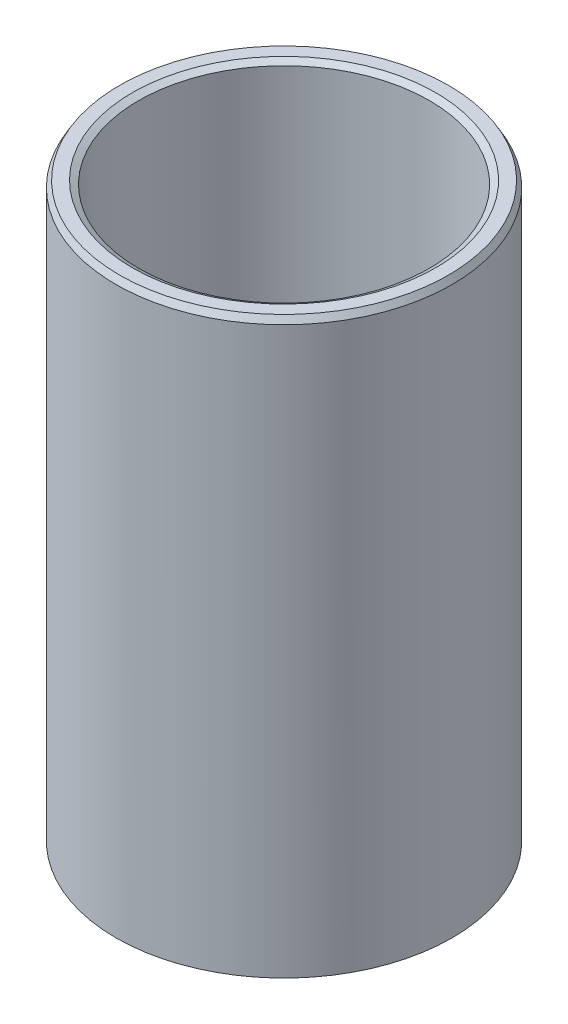
ISO-10303-21;
HEADER;
FILE_DESCRIPTION(('STEP AP214'),'2;1');
FILE_NAME('part.step','',(''),(''),'','','');
FILE_SCHEMA(('AUTOMOTIVE_DESIGN { 1 0 10303 214 1 1 1 1 }'));
ENDSEC;
DATA;
#1=APPLICATION_CONTEXT('core data for automotive mechanical design processes');
#2=APPLICATION_PROTOCOL_DEFINITION('international standard','automotive_design',2000,#1);
#3=PRODUCT_CONTEXT('',#1,'mechanical');
#4=PRODUCT('Part','Part','',(#3));
#5=PRODUCT_RELATED_PRODUCT_CATEGORY('part','',(#4));
#6=PRODUCT_DEFINITION_FORMATION('','',#4);
#7=PRODUCT_DEFINITION_CONTEXT('part definition',#1,'design');
#8=PRODUCT_DEFINITION('design','',#6,#7);
#9=PRODUCT_DEFINITION_SHAPE('','',#8);
#10=(LENGTH_UNIT() NAMED_UNIT(*) SI_UNIT(.MILLI.,.METRE.));
#11=(NAMED_UNIT(*) PLANE_ANGLE_UNIT() SI_UNIT($,.RADIAN.));
#12=(NAMED_UNIT(*) SI_UNIT($,.STERADIAN.) SOLID_ANGLE_UNIT());
#13=UNCERTAINTY_MEASURE_WITH_UNIT(LENGTH_MEASURE(1.E-05),#10,'distance_accuracy_value','');
#14=(GEOMETRIC_REPRESENTATION_CONTEXT(3) GLOBAL_UNCERTAINTY_ASSIGNED_CONTEXT((#13)) GLOBAL_UNIT_ASSIGNED_CONTEXT((#10,
#11,#12)) REPRESENTATION_CONTEXT('',''));
#15=CARTESIAN_POINT('',(0.,0.,0.));
#16=DIRECTION('',(0.,0.,1.));
#17=DIRECTION('',(1.,0.,0.));
#18=AXIS2_PLACEMENT_3D('',#15,#16,#17);
#19=CARTESIAN_POINT('',(0.,154.16567837042,0.));
#20=DIRECTION('',(0.,-1.,0.));
#21=DIRECTION('',(0.,0.,-1.));
#22=AXIS2_PLACEMENT_3D('',#19,#20,#21);
#23=CYLINDRICAL_SURFACE('',#22,45.);
#24=CARTESIAN_POINT('',(0.,0.978528132619838,0.));
#25=DIRECTION('',(0.,1.,0.));
#26=DIRECTION('',(0.,0.,1.));
#27=AXIS2_PLACEMENT_3D('',#24,#25,#26);
#28=CIRCLE('',#27,45.);
#29=CARTESIAN_POINT('',(0.,0.978528132619838,45.));
#30=VERTEX_POINT('',#29);
#31=EDGE_CURVE('E10',#30,#30,#28,.T.);
#32=ORIENTED_EDGE('',*,*,#31,.T.);
#33=EDGE_LOOP('',(#32));
#34=FACE_BOUND('',#33,.T.);
#35=CARTESIAN_POINT('',(0.,152.470817928087,0.));
#36=DIRECTION('',(0.,1.,0.));
#37=DIRECTION('',(0.,0.,1.));
#38=AXIS2_PLACEMENT_3D('',#35,#36,#37);
#39=CIRCLE('',#38,45.);
#40=CARTESIAN_POINT('',(0.,152.470817928087,-45.));
#41=VERTEX_POINT('',#40);
#42=EDGE_CURVE('E50',#41,#41,#39,.F.);
#43=ORIENTED_EDGE('',*,*,#42,.T.);
#44=EDGE_LOOP('',(#43));
#45=FACE_BOUND('',#44,.T.);
#46=ADVANCED_FACE('F39',(#34,#45),#23,.T.);
#47=CARTESIAN_POINT('',(0.,154.16567837042,0.));
#48=DIRECTION('',(0.,1.,0.));
#49=DIRECTION('',(0.,0.,1.));
#50=AXIS2_PLACEMENT_3D('',#47,#48,#49);
#51=PLANE('',#50);
#52=CARTESIAN_POINT('',(0.,154.16567837042,0.));
#53=DIRECTION('',(0.,1.,0.));
#54=DIRECTION('',(0.,0.,1.));
#55=AXIS2_PLACEMENT_3D('',#52,#53,#54);
#56=CIRCLE('',#55,40.6179186015309);
#57=CARTESIAN_POINT('',(0.,154.16567837042,40.6179186015309));
#58=VERTEX_POINT('',#57);
#59=EDGE_CURVE('E58',#58,#58,#56,.F.);
#60=ORIENTED_EDGE('',*,*,#59,.T.);
#61=EDGE_LOOP('',(#60));
#62=FACE_BOUND('',#61,.T.);
#63=CARTESIAN_POINT('',(0.,154.16567837042,0.));
#64=DIRECTION('',(0.,1.,0.));
#65=DIRECTION('',(0.,0.,1.));
#66=AXIS2_PLACEMENT_3D('',#63,#64,#65);
#67=CIRCLE('',#66,44.0214718673801);
#68=CARTESIAN_POINT('',(0.,154.16567837042,-44.0214718673801));
#69=VERTEX_POINT('',#68);
#70=EDGE_CURVE('E61',#69,#69,#67,.T.);
#71=ORIENTED_EDGE('',*,*,#70,.T.);
#72=EDGE_LOOP('',(#71));
#73=FACE_BOUND('',#72,.T.);
#74=ADVANCED_FACE('F88',(#62,#73),#51,.T.);
#75=CARTESIAN_POINT('',(0.,0.,0.));
#76=DIRECTION('',(0.,1.,0.));
#77=DIRECTION('',(0.,0.,1.));
#78=AXIS2_PLACEMENT_3D('',#75,#76,#77);
#79=PLANE('',#78);
#80=CARTESIAN_POINT('',(0.,0.,0.));
#81=DIRECTION('',(0.,1.,0.));
#82=DIRECTION('',(0.,0.,1.));
#83=AXIS2_PLACEMENT_3D('',#80,#81,#82);
#84=CIRCLE('',#83,39.9015862918177);
#85=CARTESIAN_POINT('',(0.,0.,-39.9015862918177));
#86=VERTEX_POINT('',#85);
#87=EDGE_CURVE('E51',#86,#86,#84,.T.);
#88=ORIENTED_EDGE('',*,*,#87,.T.);
#89=EDGE_LOOP('',(#88));
#90=FACE_BOUND('',#89,.T.);
#91=CARTESIAN_POINT('',(0.,0.,0.));
#92=DIRECTION('',(0.,1.,0.));
#93=DIRECTION('',(0.,0.,1.));
#94=AXIS2_PLACEMENT_3D('',#91,#92,#93);
#95=CIRCLE('',#94,43.3051395576669);
#96=CARTESIAN_POINT('',(0.,0.,43.3051395576669));
#97=VERTEX_POINT('',#96);
#98=EDGE_CURVE('E54',#97,#97,#95,.F.);
#99=ORIENTED_EDGE('',*,*,#98,.T.);
#100=EDGE_LOOP('',(#99));
#101=FACE_BOUND('',#100,.T.);
#102=ADVANCED_FACE('F83',(#90,#101),#79,.F.);
#103=CARTESIAN_POINT('',(0.,154.16567837042,0.));
#104=DIRECTION('',(0.,-1.,0.));
#105=DIRECTION('',(0.,0.,-1.));
#106=AXIS2_PLACEMENT_3D('',#103,#104,#105);
#107=CYLINDRICAL_SURFACE('',#106,38.9230581591978);
#108=CARTESIAN_POINT('',(0.,153.1871502378,0.));
#109=DIRECTION('',(0.,1.,0.));
#110=DIRECTION('',(0.,0.,1.));
#111=AXIS2_PLACEMENT_3D('',#108,#109,#110);
#112=CIRCLE('',#111,38.9230581591978);
#113=CARTESIAN_POINT('',(0.,153.1871502378,38.9230581591978));
#114=VERTEX_POINT('',#113);
#115=EDGE_CURVE('E67',#114,#114,#112,.T.);
#116=ORIENTED_EDGE('',*,*,#115,.T.);
#117=EDGE_LOOP('',(#116));
#118=FACE_BOUND('',#117,.T.);
#119=CARTESIAN_POINT('',(0.,1.69486044233311,0.));
#120=DIRECTION('',(0.,1.,0.));
#121=DIRECTION('',(0.,0.,1.));
#122=AXIS2_PLACEMENT_3D('',#119,#120,#121);
#123=CIRCLE('',#122,38.9230581591978);
#124=CARTESIAN_POINT('',(0.,1.69486044233311,-38.9230581591978));
#125=VERTEX_POINT('',#124);
#126=EDGE_CURVE('E69',#125,#125,#123,.F.);
#127=ORIENTED_EDGE('',*,*,#126,.T.);
#128=EDGE_LOOP('',(#127));
#129=FACE_BOUND('',#128,.T.);
#130=ADVANCED_FACE('F71',(#118,#129),#107,.F.);
#131=CARTESIAN_POINT('',(0.,153.1871502378,0.));
#132=DIRECTION('',(0.,1.,0.));
#133=DIRECTION('',(0.,0.,1.));
#134=AXIS2_PLACEMENT_3D('',#131,#132,#133);
#135=CONICAL_SURFACE('',#134,38.9230581591978,1.0471975511966);
#136=ORIENTED_EDGE('',*,*,#59,.F.);
#137=EDGE_LOOP('',(#136));
#138=FACE_BOUND('',#137,.T.);
#139=ORIENTED_EDGE('',*,*,#115,.F.);
#140=EDGE_LOOP('',(#139));
#141=FACE_BOUND('',#140,.T.);
#142=ADVANCED_FACE('F77',(#138,#141),#135,.F.);
#143=CARTESIAN_POINT('',(0.,0.,0.));
#144=DIRECTION('',(0.,-1.,0.));
#145=DIRECTION('',(0.,0.,-1.));
#146=AXIS2_PLACEMENT_3D('',#143,#144,#145);
#147=CONICAL_SURFACE('',#146,39.9015862918177,0.523598775598295);
#148=CARTESIAN_POINT('',(0.,1.69486044233311,-38.9230581591978));
#149=CARTESIAN_POINT('',(0.,1.6772056460588,-38.9332511605793));
#150=CARTESIAN_POINT('',(0.,1.6595508497845,-38.9434441619607));
#151=CARTESIAN_POINT('',(0.,1.62424125723589,-38.9638301647236));
#152=CARTESIAN_POINT('',(0.,1.60658646096159,-38.9740231661051));
#153=CARTESIAN_POINT('',(0.,1.57127686841299,-38.994409168868));
#154=CARTESIAN_POINT('',(0.,1.55362207213868,-39.0046021702495));
#155=CARTESIAN_POINT('',(0.,1.51831247959007,-39.0249881730124));
#156=CARTESIAN_POINT('',(0.,1.50065768331577,-39.0351811743938));
#157=CARTESIAN_POINT('',(0.,1.46534809076716,-39.0555671771567));
#158=CARTESIAN_POINT('',(0.,1.44769329449286,-39.0657601785382));
#159=CARTESIAN_POINT('',(0.,1.41238370194426,-39.0861461813011));
#160=CARTESIAN_POINT('',(0.,1.39472890566995,-39.0963391826826));
#161=CARTESIAN_POINT('',(0.,1.35941931312135,-39.1167251854455));
#162=CARTESIAN_POINT('',(0.,1.34176451684704,-39.1269181868269));
#163=CARTESIAN_POINT('',(0.,1.30645492429844,-39.1473041895899));
#164=CARTESIAN_POINT('',(0.,1.28880012802413,-39.1574971909713));
#165=CARTESIAN_POINT('',(0.,1.25349053547553,-39.1778831937342));
#166=CARTESIAN_POINT('',(0.,1.23583573920122,-39.1880761951157));
#167=CARTESIAN_POINT('',(0.,1.20052614665262,-39.2084621978786));
#168=CARTESIAN_POINT('',(0.,1.18287135037831,-39.2186551992601));
#169=CARTESIAN_POINT('',(0.,1.14756175782971,-39.239041202023));
#170=CARTESIAN_POINT('',(0.,1.1299069615554,-39.2492342034044));
#171=CARTESIAN_POINT('',(0.,1.0945973690068,-39.2696202061673));
#172=CARTESIAN_POINT('',(0.,1.0769425727325,-39.2798132075488));
#173=CARTESIAN_POINT('',(0.,1.04163298018389,-39.3001992103117));
#174=CARTESIAN_POINT('',(0.,1.02397818390958,-39.3103922116932));
#175=CARTESIAN_POINT('',(0.,0.988668591360979,-39.3307782144561));
#176=CARTESIAN_POINT('',(0.,0.971013795086676,-39.3409712158375));
#177=CARTESIAN_POINT('',(0.,0.93570420253807,-39.3613572186005));
#178=CARTESIAN_POINT('',(0.,0.918049406263767,-39.3715502199819));
#179=CARTESIAN_POINT('',(0.,0.88273981371516,-39.3919362227448));
#180=CARTESIAN_POINT('',(0.,0.865085017440856,-39.4021292241263));
#181=CARTESIAN_POINT('',(0.,0.82977542489225,-39.4225152268892));
#182=CARTESIAN_POINT('',(0.,0.812120628617948,-39.4327082282707));
#183=CARTESIAN_POINT('',(0.,0.776811036069341,-39.4530942310336));
#184=CARTESIAN_POINT('',(0.,0.759156239795037,-39.463287232415));
#185=CARTESIAN_POINT('',(0.,0.72384664724643,-39.4836732351779));
#186=CARTESIAN_POINT('',(0.,0.706191850972128,-39.4938662365594));
#187=CARTESIAN_POINT('',(0.,0.670882258423522,-39.5142522393223));
#188=CARTESIAN_POINT('',(0.,0.653227462149219,-39.5244452407038));
#189=CARTESIAN_POINT('',(0.,0.617917869600612,-39.5448312434667));
#190=CARTESIAN_POINT('',(0.,0.600263073326308,-39.5550242448481));
#191=CARTESIAN_POINT('',(0.,0.564953480777702,-39.575410247611));
#192=CARTESIAN_POINT('',(0.,0.547298684503399,-39.5856032489925));
#193=CARTESIAN_POINT('',(0.,0.511989091954793,-39.6059892517554));
#194=CARTESIAN_POINT('',(0.,0.49433429568049,-39.6161822531369));
#195=CARTESIAN_POINT('',(0.,0.459024703131883,-39.6365682558998));
#196=CARTESIAN_POINT('',(0.,0.441369906857579,-39.6467612572812));
#197=CARTESIAN_POINT('',(0.,0.406060314308973,-39.6671472600442));
#198=CARTESIAN_POINT('',(0.,0.388405518034671,-39.6773402614256));
#199=CARTESIAN_POINT('',(0.,0.353095925486065,-39.6977262641885));
#200=CARTESIAN_POINT('',(0.,0.335441129211761,-39.70791926557));
#201=CARTESIAN_POINT('',(0.,0.300131536663154,-39.7283052683329));
#202=CARTESIAN_POINT('',(0.,0.28247674038885,-39.7384982697144));
#203=CARTESIAN_POINT('',(0.,0.247167147840244,-39.7588842724773));
#204=CARTESIAN_POINT('',(0.,0.229512351565942,-39.7690772738587));
#205=CARTESIAN_POINT('',(0.,0.194202759017336,-39.7894632766216));
#206=CARTESIAN_POINT('',(0.,0.176547962743032,-39.7996562780031));
#207=CARTESIAN_POINT('',(0.,0.141238370194425,-39.820042280766));
#208=CARTESIAN_POINT('',(0.,0.123583573920122,-39.8302352821475));
#209=CARTESIAN_POINT('',(0.,0.0882739813715156,-39.8506212849104));
#210=CARTESIAN_POINT('',(0.,0.0706191850972128,-39.8608142862918));
#211=CARTESIAN_POINT('',(0.,0.0353095925486074,-39.8812002890548));
#212=CARTESIAN_POINT('',(0.,0.0176547962743046,-39.8913932904362));
#213=CARTESIAN_POINT('',(0.,0.,-39.9015862918177));
#214=B_SPLINE_CURVE_WITH_KNOTS('',3,(#148,#149,#150,#151,#152,#153,#154,#155,#156,#157,#158,
#159,#160,#161,#162,#163,#164,#165,#166,#167,#168,#169,#170,#171,#172,#173,#174,#175,#176,#177,
#178,#179,#180,#181,#182,#183,#184,#185,#186,#187,#188,#189,#190,#191,#192,#193,#194,#195,#196,
#197,#198,#199,#200,#201,#202,#203,#204,#205,#206,#207,#208,#209,#210,#211,#212,#213),
.UNSPECIFIED.,.F.,.F.,(4,2,2,2,2,2,2,2,2,2,2,2,2,2,2,2,2,2,2,2,2,2,2,2,2,2,2,2,2,2,2,2,4),(0.,
0.0611580082887404,0.122316016577484,0.183474024866225,0.244632033154965,0.305790041443709,
0.366948049732449,0.42810605802119,0.489264066309934,0.550422074598674,0.611580082887415,
0.672738091176158,0.733896099464899,0.795054107753639,0.856212116042383,0.917370124331123,
0.978528132619864,1.03968614090861,1.10084414919735,1.16200215748609,1.22316016577483,
1.28431817406357,1.34547618235232,1.40663419064106,1.4677921989298,1.52895020721854,
1.59010821550728,1.65126622379602,1.71242423208476,1.77358224037351,1.83474024866225,
1.89589825695099,1.95705626523973),.UNSPECIFIED.);
#215=EDGE_CURVE('BSEAM73',#125,#86,#214,.T.);
#216=ORIENTED_EDGE('',*,*,#126,.F.);
#217=ORIENTED_EDGE('',*,*,#87,.F.);
#218=ORIENTED_EDGE('',*,*,#215,.T.);
#219=ORIENTED_EDGE('',*,*,#215,.F.);
#220=EDGE_LOOP('',(#216,#218,#217,#219));
#221=FACE_BOUND('',#220,.T.);
#222=ADVANCED_FACE('F73',(#221),#147,.F.);
#223=CARTESIAN_POINT('',(0.,0.978528132619838,0.));
#224=DIRECTION('',(0.,1.,0.));
#225=DIRECTION('',(0.,0.,1.));
#226=AXIS2_PLACEMENT_3D('',#223,#224,#225);
#227=CONICAL_SURFACE('',#226,45.,1.0471975511966);
#228=ORIENTED_EDGE('',*,*,#98,.F.);
#229=EDGE_LOOP('',(#228));
#230=FACE_BOUND('',#229,.T.);
#231=ORIENTED_EDGE('',*,*,#31,.F.);
#232=EDGE_LOOP('',(#231));
#233=FACE_BOUND('',#232,.T.);
#234=ADVANCED_FACE('F76',(#230,#233),#227,.T.);
#235=CARTESIAN_POINT('',(0.,154.16567837042,0.));
#236=DIRECTION('',(0.,-1.,0.));
#237=DIRECTION('',(0.,0.,-1.));
#238=AXIS2_PLACEMENT_3D('',#235,#236,#237);
#239=CONICAL_SURFACE('',#238,44.0214718673801,0.523598775598299);
#240=CARTESIAN_POINT('',(0.,152.470817928087,-45.));
#241=CARTESIAN_POINT('',(0.,152.488472724361,-44.9898069986186));
#242=CARTESIAN_POINT('',(0.,152.506127520635,-44.9796139972371));
#243=CARTESIAN_POINT('',(0.,152.541437113184,-44.9592279944742));
#244=CARTESIAN_POINT('',(0.,152.559091909458,-44.9490349930927));
#245=CARTESIAN_POINT('',(0.,152.594401502007,-44.9286489903298));
#246=CARTESIAN_POINT('',(0.,152.612056298281,-44.9184559889484));
#247=CARTESIAN_POINT('',(0.,152.64736589083,-44.8980699861854));
#248=CARTESIAN_POINT('',(0.,152.665020687104,-44.887876984804));
#249=CARTESIAN_POINT('',(0.,152.700330279653,-44.8674909820411));
#250=CARTESIAN_POINT('',(0.,152.717985075927,-44.8572979806596));
#251=CARTESIAN_POINT('',(0.,152.753294668476,-44.8369119778967));
#252=CARTESIAN_POINT('',(0.,152.77094946475,-44.8267189765152));
#253=CARTESIAN_POINT('',(0.,152.806259057298,-44.8063329737523));
#254=CARTESIAN_POINT('',(0.,152.823913853573,-44.7961399723709));
#255=CARTESIAN_POINT('',(0.,152.859223446121,-44.7757539696079));
#256=CARTESIAN_POINT('',(0.,152.876878242396,-44.7655609682265));
#257=CARTESIAN_POINT('',(0.,152.912187834944,-44.7451749654636));
#258=CARTESIAN_POINT('',(0.,152.929842631219,-44.7349819640821));
#259=CARTESIAN_POINT('',(0.,152.965152223767,-44.7145959613192));
#260=CARTESIAN_POINT('',(0.,152.982807020041,-44.7044029599378));
#261=CARTESIAN_POINT('',(0.,153.01811661259,-44.6840169571748));
#262=CARTESIAN_POINT('',(0.,153.035771408864,-44.6738239557934));
#263=CARTESIAN_POINT('',(0.,153.071081001413,-44.6534379530305));
#264=CARTESIAN_POINT('',(0.,153.088735797687,-44.643244951649));
#265=CARTESIAN_POINT('',(0.,153.124045390236,-44.6228589488861));
#266=CARTESIAN_POINT('',(0.,153.14170018651,-44.6126659475046));
#267=CARTESIAN_POINT('',(0.,153.177009779059,-44.5922799447417));
#268=CARTESIAN_POINT('',(0.,153.194664575333,-44.5820869433603));
#269=CARTESIAN_POINT('',(0.,153.229974167882,-44.5617009405974));
#270=CARTESIAN_POINT('',(0.,153.247628964156,-44.5515079392159));
#271=CARTESIAN_POINT('',(0.,153.282938556705,-44.531121936453));
#272=CARTESIAN_POINT('',(0.,153.300593352979,-44.5209289350715));
#273=CARTESIAN_POINT('',(0.,153.335902945528,-44.5005429323086));
#274=CARTESIAN_POINT('',(0.,153.353557741802,-44.4903499309271));
#275=CARTESIAN_POINT('',(0.,153.38886733435,-44.4699639281642));
#276=CARTESIAN_POINT('',(0.,153.406522130625,-44.4597709267828));
#277=CARTESIAN_POINT('',(0.,153.441831723173,-44.4393849240199));
#278=CARTESIAN_POINT('',(0.,153.459486519448,-44.4291919226384));
#279=CARTESIAN_POINT('',(0.,153.494796111996,-44.4088059198755));
#280=CARTESIAN_POINT('',(0.,153.512450908271,-44.398612918494));
#281=CARTESIAN_POINT('',(0.,153.547760500819,-44.3782269157311));
#282=CARTESIAN_POINT('',(0.,153.565415297094,-44.3680339143497));
#283=CARTESIAN_POINT('',(0.,153.600724889642,-44.3476479115867));
#284=CARTESIAN_POINT('',(0.,153.618379685916,-44.3374549102053));
#285=CARTESIAN_POINT('',(0.,153.653689278465,-44.3170689074424));
#286=CARTESIAN_POINT('',(0.,153.671344074739,-44.3068759060609));
#287=CARTESIAN_POINT('',(0.,153.706653667288,-44.286489903298));
#288=CARTESIAN_POINT('',(0.,153.724308463562,-44.2762969019165));
#289=CARTESIAN_POINT('',(0.,153.759618056111,-44.2559108991536));
#290=CARTESIAN_POINT('',(0.,153.777272852385,-44.2457178977722));
#291=CARTESIAN_POINT('',(0.,153.812582444934,-44.2253318950093));
#292=CARTESIAN_POINT('',(0.,153.830237241208,-44.2151388936278));
#293=CARTESIAN_POINT('',(0.,153.865546833757,-44.1947528908649));
#294=CARTESIAN_POINT('',(0.,153.883201630031,-44.1845598894834));
#295=CARTESIAN_POINT('',(0.,153.91851122258,-44.1641738867205));
#296=CARTESIAN_POINT('',(0.,153.936166018854,-44.1539808853391));
#297=CARTESIAN_POINT('',(0.,153.971475611402,-44.1335948825761));
#298=CARTESIAN_POINT('',(0.,153.989130407677,-44.1234018811947));
#299=CARTESIAN_POINT('',(0.,154.024440000225,-44.1030158784318));
#300=CARTESIAN_POINT('',(0.,154.0420947965,-44.0928228770503));
#301=CARTESIAN_POINT('',(0.,154.077404389048,-44.0724368742874));
#302=CARTESIAN_POINT('',(0.,154.095059185323,-44.0622438729059));
#303=CARTESIAN_POINT('',(0.,154.130368777871,-44.041857870143));
#304=CARTESIAN_POINT('',(0.,154.148023574146,-44.0316648687616));
#305=CARTESIAN_POINT('',(0.,154.16567837042,-44.0214718673801));
#306=B_SPLINE_CURVE_WITH_KNOTS('',3,(#240,#241,#242,#243,#244,#245,#246,#247,#248,#249,#250,
#251,#252,#253,#254,#255,#256,#257,#258,#259,#260,#261,#262,#263,#264,#265,#266,#267,#268,#269,
#270,#271,#272,#273,#274,#275,#276,#277,#278,#279,#280,#281,#282,#283,#284,#285,#286,#287,#288,
#289,#290,#291,#292,#293,#294,#295,#296,#297,#298,#299,#300,#301,#302,#303,#304,#305),
.UNSPECIFIED.,.F.,.F.,(4,2,2,2,2,2,2,2,2,2,2,2,2,2,2,2,2,2,2,2,2,2,2,2,2,2,2,2,2,2,2,2,4),(0.,
0.0611580082887622,0.122316016577504,0.183474024866242,0.244632033154984,0.305790041443722,
0.366948049732463,0.428106058021229,0.489264066309967,0.550422074598709,0.611580082887447,
0.672738091176188,0.733896099464927,0.795054107753692,0.85621211604243,0.917370124331172,
0.97852813261991,1.03968614090865,1.10084414919739,1.16200215748613,1.22316016577489,
1.28431817406364,1.34547618235238,1.40663419064112,1.46779219892986,1.52895020721859,
1.59010821550736,1.6512662237961,1.71242423208484,1.77358224037358,1.83474024866232,
1.89589825695106,1.95705626523982),.UNSPECIFIED.);
#307=EDGE_CURVE('BSEAM45',#41,#69,#306,.T.);
#308=ORIENTED_EDGE('',*,*,#42,.F.);
#309=ORIENTED_EDGE('',*,*,#70,.F.);
#310=ORIENTED_EDGE('',*,*,#307,.T.);
#311=ORIENTED_EDGE('',*,*,#307,.F.);
#312=EDGE_LOOP('',(#308,#310,#309,#311));
#313=FACE_BOUND('',#312,.T.);
#314=ADVANCED_FACE('F45',(#313),#239,.T.);
#315=CLOSED_SHELL('',(#46,#74,#102,#130,#142,#222,#234,#314));
#316=MANIFOLD_SOLID_BREP('B2',#315);
#317=ADVANCED_BREP_SHAPE_REPRESENTATION('',(#18,#316),#14);
#318=SHAPE_DEFINITION_REPRESENTATION(#9,#317);
ENDSEC;
END-ISO-10303-21;
